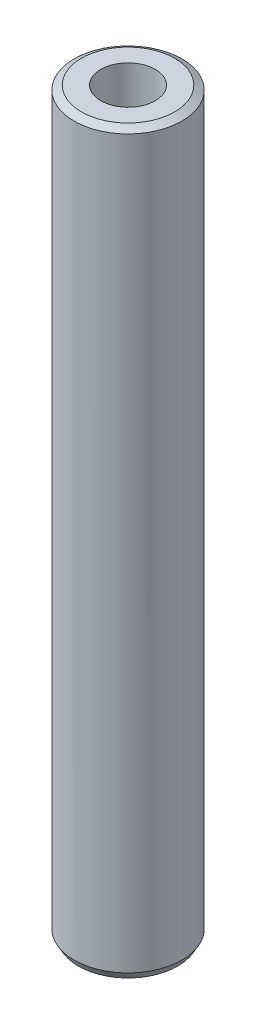
ISO-10303-21;
HEADER;
FILE_DESCRIPTION(('STEP AP214'),'2;1');
FILE_NAME('part.step','',(''),(''),'','','');
FILE_SCHEMA(('AUTOMOTIVE_DESIGN { 1 0 10303 214 1 1 1 1 }'));
ENDSEC;
DATA;
#1=APPLICATION_CONTEXT('core data for automotive mechanical design processes');
#2=APPLICATION_PROTOCOL_DEFINITION('international standard','automotive_design',2000,#1);
#3=PRODUCT_CONTEXT('',#1,'mechanical');
#4=PRODUCT('Part','Part','',(#3));
#5=PRODUCT_RELATED_PRODUCT_CATEGORY('part','',(#4));
#6=PRODUCT_DEFINITION_FORMATION('','',#4);
#7=PRODUCT_DEFINITION_CONTEXT('part definition',#1,'design');
#8=PRODUCT_DEFINITION('design','',#6,#7);
#9=PRODUCT_DEFINITION_SHAPE('','',#8);
#10=(LENGTH_UNIT() NAMED_UNIT(*) SI_UNIT(.MILLI.,.METRE.));
#11=(NAMED_UNIT(*) PLANE_ANGLE_UNIT() SI_UNIT($,.RADIAN.));
#12=(NAMED_UNIT(*) SI_UNIT($,.STERADIAN.) SOLID_ANGLE_UNIT());
#13=UNCERTAINTY_MEASURE_WITH_UNIT(LENGTH_MEASURE(1.E-05),#10,'distance_accuracy_value','');
#14=(GEOMETRIC_REPRESENTATION_CONTEXT(3) GLOBAL_UNCERTAINTY_ASSIGNED_CONTEXT((#13)) GLOBAL_UNIT_ASSIGNED_CONTEXT((#10,
#11,#12)) REPRESENTATION_CONTEXT('',''));
#15=CARTESIAN_POINT('',(0.,0.,0.));
#16=DIRECTION('',(0.,0.,1.));
#17=DIRECTION('',(1.,0.,0.));
#18=AXIS2_PLACEMENT_3D('',#15,#16,#17);
#19=CARTESIAN_POINT('',(0.,308.106444549777,0.));
#20=DIRECTION('',(0.,-1.,0.));
#21=DIRECTION('',(0.,0.,-1.));
#22=AXIS2_PLACEMENT_3D('',#19,#20,#21);
#23=CYLINDRICAL_SURFACE('',#22,22.5);
#24=CARTESIAN_POINT('',(0.,306.330320871958,0.));
#25=DIRECTION('',(0.,1.,0.));
#26=DIRECTION('',(0.,0.,1.));
#27=AXIS2_PLACEMENT_3D('',#24,#25,#26);
#28=CIRCLE('',#27,22.5);
#29=CARTESIAN_POINT('',(0.,306.330320871958,-22.5));
#30=VERTEX_POINT('',#29);
#31=EDGE_CURVE('E50',#30,#30,#28,.F.);
#32=CARTESIAN_POINT('',(0.,3.07633645050798,0.));
#33=DIRECTION('',(0.,1.,0.));
#34=DIRECTION('',(0.,0.,1.));
#35=AXIS2_PLACEMENT_3D('',#32,#33,#34);
#36=CIRCLE('',#35,22.5);
#37=CARTESIAN_POINT('',(0.,3.07633645050798,-22.5));
#38=VERTEX_POINT('',#37);
#39=EDGE_CURVE('E51',#38,#38,#36,.T.);
#40=CARTESIAN_POINT('',(0.,306.330320871958,-22.5));
#41=CARTESIAN_POINT('',(0.,303.171425200901,-22.5));
#42=CARTESIAN_POINT('',(0.,300.012529529844,-22.5));
#43=CARTESIAN_POINT('',(0.,293.694738187731,-22.5));
#44=CARTESIAN_POINT('',(0.,290.535842516674,-22.5));
#45=CARTESIAN_POINT('',(0.,284.21805117456,-22.5));
#46=CARTESIAN_POINT('',(0.,281.059155503504,-22.5));
#47=CARTESIAN_POINT('',(0.,274.74136416139,-22.5));
#48=CARTESIAN_POINT('',(0.,271.582468490333,-22.5));
#49=CARTESIAN_POINT('',(0.,265.26467714822,-22.5));
#50=CARTESIAN_POINT('',(0.,262.105781477163,-22.5));
#51=CARTESIAN_POINT('',(0.,255.787990135049,-22.5));
#52=CARTESIAN_POINT('',(0.,252.629094463993,-22.5));
#53=CARTESIAN_POINT('',(0.,246.311303121879,-22.5));
#54=CARTESIAN_POINT('',(0.,243.152407450822,-22.5));
#55=CARTESIAN_POINT('',(0.,236.834616108709,-22.5));
#56=CARTESIAN_POINT('',(0.,233.675720437652,-22.5));
#57=CARTESIAN_POINT('',(0.,227.357929095539,-22.5));
#58=CARTESIAN_POINT('',(0.,224.199033424482,-22.5));
#59=CARTESIAN_POINT('',(0.,217.881242082368,-22.5));
#60=CARTESIAN_POINT('',(0.,214.722346411311,-22.5));
#61=CARTESIAN_POINT('',(0.,208.404555069198,-22.5));
#62=CARTESIAN_POINT('',(0.,205.245659398141,-22.5));
#63=CARTESIAN_POINT('',(0.,198.927868056028,-22.5));
#64=CARTESIAN_POINT('',(0.,195.768972384971,-22.5));
#65=CARTESIAN_POINT('',(0.,189.451181042857,-22.5));
#66=CARTESIAN_POINT('',(0.,186.292285371801,-22.5));
#67=CARTESIAN_POINT('',(0.,179.974494029687,-22.5));
#68=CARTESIAN_POINT('',(0.,176.81559835863,-22.5));
#69=CARTESIAN_POINT('',(0.,170.497807016517,-22.5));
#70=CARTESIAN_POINT('',(0.,167.33891134546,-22.5));
#71=CARTESIAN_POINT('',(0.,161.021120003346,-22.5));
#72=CARTESIAN_POINT('',(0.,157.86222433229,-22.5));
#73=CARTESIAN_POINT('',(0.,151.544432990176,-22.5));
#74=CARTESIAN_POINT('',(0.,148.385537319119,-22.5));
#75=CARTESIAN_POINT('',(0.,142.067745977006,-22.5));
#76=CARTESIAN_POINT('',(0.,138.908850305949,-22.5));
#77=CARTESIAN_POINT('',(0.,132.591058963836,-22.5));
#78=CARTESIAN_POINT('',(0.,129.432163292779,-22.5));
#79=CARTESIAN_POINT('',(0.,123.114371950665,-22.5));
#80=CARTESIAN_POINT('',(0.,119.955476279608,-22.5));
#81=CARTESIAN_POINT('',(0.,113.637684937495,-22.5));
#82=CARTESIAN_POINT('',(0.,110.478789266438,-22.5));
#83=CARTESIAN_POINT('',(0.,104.160997924325,-22.5));
#84=CARTESIAN_POINT('',(0.,101.002102253268,-22.5));
#85=CARTESIAN_POINT('',(0.,94.6843109111543,-22.5));
#86=CARTESIAN_POINT('',(0.,91.5254152400975,-22.5));
#87=CARTESIAN_POINT('',(0.,85.207623897984,-22.5));
#88=CARTESIAN_POINT('',(0.,82.0487282269272,-22.5));
#89=CARTESIAN_POINT('',(0.,75.7309368848137,-22.5));
#90=CARTESIAN_POINT('',(0.,72.5720412137569,-22.5));
#91=CARTESIAN_POINT('',(0.,66.2542498716434,-22.5));
#92=CARTESIAN_POINT('',(0.,63.0953542005866,-22.5));
#93=CARTESIAN_POINT('',(0.,56.7775628584731,-22.5));
#94=CARTESIAN_POINT('',(0.,53.6186671874163,-22.5));
#95=CARTESIAN_POINT('',(0.,47.3008758453027,-22.5));
#96=CARTESIAN_POINT('',(0.,44.141980174246,-22.5));
#97=CARTESIAN_POINT('',(0.,37.8241888321325,-22.5));
#98=CARTESIAN_POINT('',(0.,34.6652931610757,-22.5));
#99=CARTESIAN_POINT('',(0.,28.3475018189622,-22.5));
#100=CARTESIAN_POINT('',(0.,25.1886061479054,-22.5));
#101=CARTESIAN_POINT('',(0.,18.8708148057919,-22.5));
#102=CARTESIAN_POINT('',(0.,15.7119191347351,-22.5));
#103=CARTESIAN_POINT('',(0.,9.3941277926215,-22.5));
#104=CARTESIAN_POINT('',(0.,6.23523212156474,-22.5));
#105=CARTESIAN_POINT('',(0.,3.07633645050798,-22.5));
#106=B_SPLINE_CURVE_WITH_KNOTS('',3,(#40,#41,#42,#43,#44,#45,#46,#47,#48,#49,#50,#51,#52,#53,
#54,#55,#56,#57,#58,#59,#60,#61,#62,#63,#64,#65,#66,#67,#68,#69,#70,#71,#72,#73,#74,#75,#76,#77,
#78,#79,#80,#81,#82,#83,#84,#85,#86,#87,#88,#89,#90,#91,#92,#93,#94,#95,#96,#97,#98,#99,#100,
#101,#102,#103,#104,#105),.UNSPECIFIED.,.F.,.F.,(4,2,2,2,2,2,2,2,2,2,2,2,2,2,2,2,2,2,2,2,2,2,2,
2,2,2,2,2,2,2,2,2,4),(0.,9.47668701317028,18.9533740263406,28.4300610395109,37.9067480526812,
47.3834350658515,56.8601220790218,66.3368090921921,75.8134961053624,85.2901831185327,
94.766870131703,104.243557144873,113.720244158044,123.196931171214,132.673618184384,
142.150305197555,151.626992210725,161.103679223895,170.580366237065,180.057053250236,
189.533740263406,199.010427276576,208.487114289747,217.963801302917,227.440488316087,
236.917175329258,246.393862342428,255.870549355598,265.347236368769,274.823923381939,
284.300610395109,293.77729740828,303.25398442145),.UNSPECIFIED.);
#107=EDGE_CURVE('BSEAM39',#30,#38,#106,.T.);
#108=ORIENTED_EDGE('',*,*,#31,.T.);
#109=ORIENTED_EDGE('',*,*,#39,.T.);
#110=ORIENTED_EDGE('',*,*,#107,.T.);
#111=ORIENTED_EDGE('',*,*,#107,.F.);
#112=EDGE_LOOP('',(#108,#110,#109,#111));
#113=FACE_BOUND('',#112,.T.);
#114=ADVANCED_FACE('F39',(#113),#23,.T.);
#115=CARTESIAN_POINT('',(0.,308.106444549777,0.));
#116=DIRECTION('',(0.,1.,0.));
#117=DIRECTION('',(0.,0.,1.));
#118=AXIS2_PLACEMENT_3D('',#115,#116,#117);
#119=PLANE('',#118);
#120=CARTESIAN_POINT('',(0.,308.106444549777,0.));
#121=DIRECTION('',(0.,1.,0.));
#122=DIRECTION('',(0.,0.,1.));
#123=AXIS2_PLACEMENT_3D('',#120,#121,#122);
#124=CIRCLE('',#123,19.4236635494919);
#125=CARTESIAN_POINT('',(0.,308.106444549777,-19.4236635494919));
#126=VERTEX_POINT('',#125);
#127=EDGE_CURVE('E54',#126,#126,#124,.T.);
#128=ORIENTED_EDGE('',*,*,#127,.T.);
#129=EDGE_LOOP('',(#128));
#130=FACE_BOUND('',#129,.T.);
#131=CARTESIAN_POINT('',(0.,308.106444549777,0.));
#132=DIRECTION('',(0.,1.,0.));
#133=DIRECTION('',(0.,0.,1.));
#134=AXIS2_PLACEMENT_3D('',#131,#132,#133);
#135=CIRCLE('',#134,11.3654063326877);
#136=CARTESIAN_POINT('',(0.,308.106444549777,11.3654063326877));
#137=VERTEX_POINT('',#136);
#138=EDGE_CURVE('E58',#137,#137,#135,.T.);
#139=ORIENTED_EDGE('',*,*,#138,.F.);
#140=EDGE_LOOP('',(#139));
#141=FACE_BOUND('',#140,.T.);
#142=ADVANCED_FACE('F69',(#130,#141),#119,.T.);
#143=CARTESIAN_POINT('',(0.,0.,0.));
#144=DIRECTION('',(0.,1.,0.));
#145=DIRECTION('',(0.,0.,1.));
#146=AXIS2_PLACEMENT_3D('',#143,#144,#145);
#147=PLANE('',#146);
#148=CARTESIAN_POINT('',(0.,0.,0.));
#149=DIRECTION('',(0.,1.,0.));
#150=DIRECTION('',(0.,0.,1.));
#151=AXIS2_PLACEMENT_3D('',#148,#149,#150);
#152=CIRCLE('',#151,20.7238763221813);
#153=CARTESIAN_POINT('',(0.,0.,20.7238763221813));
#154=VERTEX_POINT('',#153);
#155=EDGE_CURVE('E10',#154,#154,#152,.F.);
#156=ORIENTED_EDGE('',*,*,#155,.T.);
#157=EDGE_LOOP('',(#156));
#158=FACE_BOUND('',#157,.T.);
#159=CARTESIAN_POINT('',(0.,0.,0.));
#160=DIRECTION('',(0.,1.,0.));
#161=DIRECTION('',(0.,0.,1.));
#162=AXIS2_PLACEMENT_3D('',#159,#160,#161);
#163=CIRCLE('',#162,11.3654063326877);
#164=CARTESIAN_POINT('',(0.,0.,11.3654063326877));
#165=VERTEX_POINT('',#164);
#166=EDGE_CURVE('E63',#165,#165,#163,.T.);
#167=ORIENTED_EDGE('',*,*,#166,.T.);
#168=EDGE_LOOP('',(#167));
#169=FACE_BOUND('',#168,.T.);
#170=ADVANCED_FACE('F75',(#158,#169),#147,.F.);
#171=CARTESIAN_POINT('',(0.,308.106444549777,0.));
#172=DIRECTION('',(0.,-1.,0.));
#173=DIRECTION('',(0.,0.,-1.));
#174=AXIS2_PLACEMENT_3D('',#171,#172,#173);
#175=CYLINDRICAL_SURFACE('',#174,11.3654063326877);
#176=ORIENTED_EDGE('',*,*,#138,.T.);
#177=EDGE_LOOP('',(#176));
#178=FACE_BOUND('',#177,.T.);
#179=ORIENTED_EDGE('',*,*,#166,.F.);
#180=EDGE_LOOP('',(#179));
#181=FACE_BOUND('',#180,.T.);
#182=ADVANCED_FACE('F70',(#178,#181),#175,.F.);
#183=CARTESIAN_POINT('',(0.,308.106444549777,0.));
#184=DIRECTION('',(0.,-1.,0.));
#185=DIRECTION('',(0.,0.,-1.));
#186=AXIS2_PLACEMENT_3D('',#183,#184,#185);
#187=CONICAL_SURFACE('',#186,19.4236635494919,1.0471975511966);
#188=CARTESIAN_POINT('',(0.,306.330320871958,-22.5));
#189=CARTESIAN_POINT('',(0.,306.348822160268,-22.4679548286406));
#190=CARTESIAN_POINT('',(0.,306.367323448579,-22.4359096572811));
#191=CARTESIAN_POINT('',(0.,306.4043260252,-22.3718193145622));
#192=CARTESIAN_POINT('',(0.,306.422827313511,-22.3397741432028));
#193=CARTESIAN_POINT('',(0.,306.459829890132,-22.2756838004838));
#194=CARTESIAN_POINT('',(0.,306.478331178443,-22.2436386291244));
#195=CARTESIAN_POINT('',(0.,306.515333755064,-22.1795482864055));
#196=CARTESIAN_POINT('',(0.,306.533835043375,-22.147503115046));
#197=CARTESIAN_POINT('',(0.,306.570837619996,-22.0834127723271));
#198=CARTESIAN_POINT('',(0.,306.589338908306,-22.0513676009676));
#199=CARTESIAN_POINT('',(0.,306.626341484928,-21.9872772582487));
#200=CARTESIAN_POINT('',(0.,306.644842773238,-21.9552320868892));
#201=CARTESIAN_POINT('',(0.,306.681845349859,-21.8911417441703));
#202=CARTESIAN_POINT('',(0.,306.70034663817,-21.8590965728109));
#203=CARTESIAN_POINT('',(0.,306.737349214791,-21.7950062300919));
#204=CARTESIAN_POINT('',(0.,306.755850503102,-21.7629610587325));
#205=CARTESIAN_POINT('',(0.,306.792853079723,-21.6988707160136));
#206=CARTESIAN_POINT('',(0.,306.811354368034,-21.6668255446541));
#207=CARTESIAN_POINT('',(0.,306.848356944655,-21.6027352019352));
#208=CARTESIAN_POINT('',(0.,306.866858232966,-21.5706900305757));
#209=CARTESIAN_POINT('',(0.,306.903860809587,-21.5065996878568));
#210=CARTESIAN_POINT('',(0.,306.922362097897,-21.4745545164973));
#211=CARTESIAN_POINT('',(0.,306.959364674519,-21.4104641737784));
#212=CARTESIAN_POINT('',(0.,306.977865962829,-21.378419002419));
#213=CARTESIAN_POINT('',(0.,307.01486853945,-21.3143286597));
#214=CARTESIAN_POINT('',(0.,307.033369827761,-21.2822834883406));
#215=CARTESIAN_POINT('',(0.,307.070372404382,-21.2181931456217));
#216=CARTESIAN_POINT('',(0.,307.088873692693,-21.1861479742622));
#217=CARTESIAN_POINT('',(0.,307.125876269314,-21.1220576315433));
#218=CARTESIAN_POINT('',(0.,307.144377557625,-21.0900124601838));
#219=CARTESIAN_POINT('',(0.,307.181380134246,-21.0259221174649));
#220=CARTESIAN_POINT('',(0.,307.199881422557,-20.9938769461054));
#221=CARTESIAN_POINT('',(0.,307.236883999178,-20.9297866033865));
#222=CARTESIAN_POINT('',(0.,307.255385287488,-20.8977414320271));
#223=CARTESIAN_POINT('',(0.,307.29238786411,-20.8336510893082));
#224=CARTESIAN_POINT('',(0.,307.31088915242,-20.8016059179487));
#225=CARTESIAN_POINT('',(0.,307.347891729041,-20.7375155752298));
#226=CARTESIAN_POINT('',(0.,307.366393017352,-20.7054704038703));
#227=CARTESIAN_POINT('',(0.,307.403395593973,-20.6413800611514));
#228=CARTESIAN_POINT('',(0.,307.421896882284,-20.6093348897919));
#229=CARTESIAN_POINT('',(0.,307.458899458905,-20.545244547073));
#230=CARTESIAN_POINT('',(0.,307.477400747216,-20.5131993757136));
#231=CARTESIAN_POINT('',(0.,307.514403323837,-20.4491090329946));
#232=CARTESIAN_POINT('',(0.,307.532904612148,-20.4170638616352));
#233=CARTESIAN_POINT('',(0.,307.569907188769,-20.3529735189163));
#234=CARTESIAN_POINT('',(0.,307.588408477079,-20.3209283475568));
#235=CARTESIAN_POINT('',(0.,307.625411053701,-20.2568380048379));
#236=CARTESIAN_POINT('',(0.,307.643912342011,-20.2247928334784));
#237=CARTESIAN_POINT('',(0.,307.680914918632,-20.1607024907595));
#238=CARTESIAN_POINT('',(0.,307.699416206943,-20.1286573194));
#239=CARTESIAN_POINT('',(0.,307.736418783564,-20.0645669766811));
#240=CARTESIAN_POINT('',(0.,307.754920071875,-20.0325218053217));
#241=CARTESIAN_POINT('',(0.,307.791922648496,-19.9684314626027));
#242=CARTESIAN_POINT('',(0.,307.810423936807,-19.9363862912433));
#243=CARTESIAN_POINT('',(0.,307.847426513428,-19.8722959485244));
#244=CARTESIAN_POINT('',(0.,307.865927801739,-19.8402507771649));
#245=CARTESIAN_POINT('',(0.,307.90293037836,-19.776160434446));
#246=CARTESIAN_POINT('',(0.,307.92143166667,-19.7441152630865));
#247=CARTESIAN_POINT('',(0.,307.958434243292,-19.6800249203676));
#248=CARTESIAN_POINT('',(0.,307.976935531602,-19.6479797490081));
#249=CARTESIAN_POINT('',(0.,308.013938108223,-19.5838894062892));
#250=CARTESIAN_POINT('',(0.,308.032439396534,-19.5518442349298));
#251=CARTESIAN_POINT('',(0.,308.069441973155,-19.4877538922108));
#252=CARTESIAN_POINT('',(0.,308.087943261466,-19.4557087208514));
#253=CARTESIAN_POINT('',(0.,308.106444549777,-19.4236635494919));
#254=B_SPLINE_CURVE_WITH_KNOTS('',3,(#188,#189,#190,#191,#192,#193,#194,#195,#196,#197,#198,
#199,#200,#201,#202,#203,#204,#205,#206,#207,#208,#209,#210,#211,#212,#213,#214,#215,#216,#217,
#218,#219,#220,#221,#222,#223,#224,#225,#226,#227,#228,#229,#230,#231,#232,#233,#234,#235,#236,
#237,#238,#239,#240,#241,#242,#243,#244,#245,#246,#247,#248,#249,#250,#251,#252,#253),
.UNSPECIFIED.,.F.,.F.,(4,2,2,2,2,2,2,2,2,2,2,2,2,2,2,2,2,2,2,2,2,2,2,2,2,2,2,2,2,2,2,2,4),(0.,
0.111007729863654,0.222015459727339,0.333023189590994,0.444030919454676,0.555038649318333,
0.666046379182015,0.777054109045669,0.888061838909354,0.999069568773008,1.11007729863669,
1.22108502850035,1.33209275836403,1.44310048822769,1.55410821809137,1.66511594795502,
1.77612367781871,1.88713140768239,1.99813913754604,2.10914686740973,2.22015459727338,
2.33116232713707,2.44217005700072,2.5531777868644,2.66418551672806,2.77519324659174,
2.8862009764554,2.99720870631908,3.10821643618274,3.21922416604642,3.33023189591007,
3.44123962577376,3.55224735563744),.UNSPECIFIED.);
#255=EDGE_CURVE('BSEAM81',#30,#126,#254,.T.);
#256=ORIENTED_EDGE('',*,*,#31,.F.);
#257=ORIENTED_EDGE('',*,*,#127,.F.);
#258=ORIENTED_EDGE('',*,*,#255,.T.);
#259=ORIENTED_EDGE('',*,*,#255,.F.);
#260=EDGE_LOOP('',(#256,#258,#257,#259));
#261=FACE_BOUND('',#260,.T.);
#262=ADVANCED_FACE('F81',(#261),#187,.T.);
#263=CARTESIAN_POINT('',(0.,3.07633645050798,0.));
#264=DIRECTION('',(0.,1.,0.));
#265=DIRECTION('',(0.,0.,1.));
#266=AXIS2_PLACEMENT_3D('',#263,#264,#265);
#267=CONICAL_SURFACE('',#266,22.5,0.523598775598305);
#268=ORIENTED_EDGE('',*,*,#155,.F.);
#269=EDGE_LOOP('',(#268));
#270=FACE_BOUND('',#269,.T.);
#271=ORIENTED_EDGE('',*,*,#39,.F.);
#272=EDGE_LOOP('',(#271));
#273=FACE_BOUND('',#272,.T.);
#274=ADVANCED_FACE('F45',(#270,#273),#267,.T.);
#275=CLOSED_SHELL('',(#114,#142,#170,#182,#262,#274));
#276=MANIFOLD_SOLID_BREP('B2',#275);
#277=ADVANCED_BREP_SHAPE_REPRESENTATION('',(#18,#276),#14);
#278=SHAPE_DEFINITION_REPRESENTATION(#9,#277);
ENDSEC;
END-ISO-10303-21;
